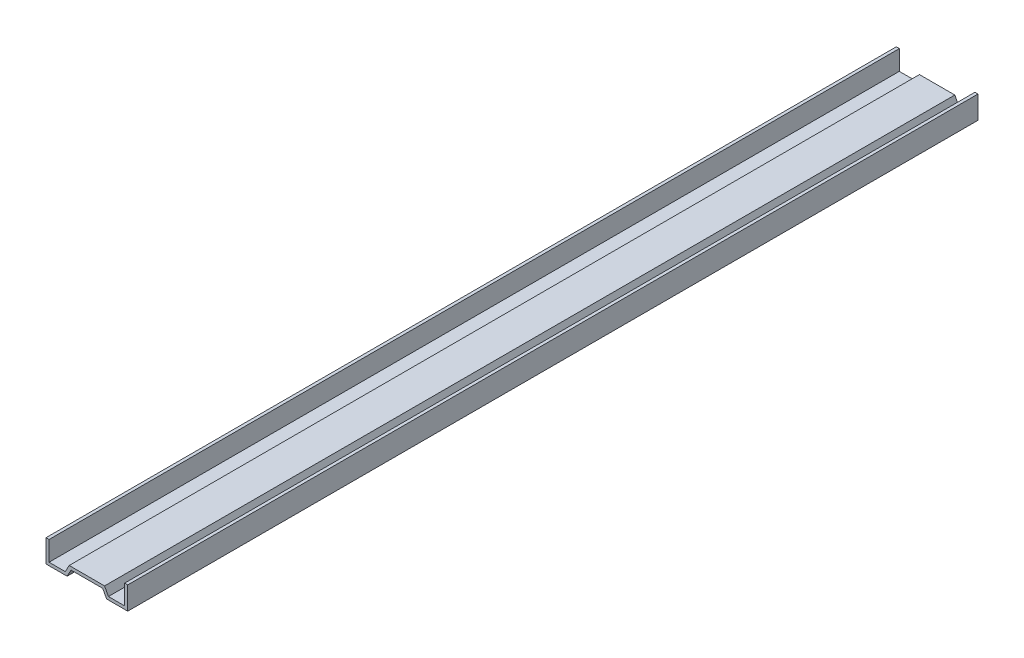
ISO-10303-21;
HEADER;
FILE_DESCRIPTION(('STEP AP214'),'2;1');
FILE_NAME('part.step','',(''),(''),'','','');
FILE_SCHEMA(('AUTOMOTIVE_DESIGN { 1 0 10303 214 1 1 1 1 }'));
ENDSEC;
DATA;
#1=APPLICATION_CONTEXT('core data for automotive mechanical design processes');
#2=APPLICATION_PROTOCOL_DEFINITION('international standard','automotive_design',2000,#1);
#3=PRODUCT_CONTEXT('',#1,'mechanical');
#4=PRODUCT('Part','Part','',(#3));
#5=PRODUCT_RELATED_PRODUCT_CATEGORY('part','',(#4));
#6=PRODUCT_DEFINITION_FORMATION('','',#4);
#7=PRODUCT_DEFINITION_CONTEXT('part definition',#1,'design');
#8=PRODUCT_DEFINITION('design','',#6,#7);
#9=PRODUCT_DEFINITION_SHAPE('','',#8);
#10=(LENGTH_UNIT() NAMED_UNIT(*) SI_UNIT(.MILLI.,.METRE.));
#11=(NAMED_UNIT(*) PLANE_ANGLE_UNIT() SI_UNIT($,.RADIAN.));
#12=(NAMED_UNIT(*) SI_UNIT($,.STERADIAN.) SOLID_ANGLE_UNIT());
#13=UNCERTAINTY_MEASURE_WITH_UNIT(LENGTH_MEASURE(1.E-05),#10,'distance_accuracy_value','');
#14=(GEOMETRIC_REPRESENTATION_CONTEXT(3) GLOBAL_UNCERTAINTY_ASSIGNED_CONTEXT((#13)) GLOBAL_UNIT_ASSIGNED_CONTEXT((#10,
#11,#12)) REPRESENTATION_CONTEXT('',''));
#15=CARTESIAN_POINT('',(0.,0.,0.));
#16=DIRECTION('',(0.,0.,1.));
#17=DIRECTION('',(1.,0.,0.));
#18=AXIS2_PLACEMENT_3D('',#15,#16,#17);
#19=CARTESIAN_POINT('',(16.1,5.30454486616186,0.));
#20=DIRECTION('',(0.,1.,0.));
#21=DIRECTION('',(0.,0.,1.));
#22=AXIS2_PLACEMENT_3D('',#19,#20,#21);
#23=PLANE('',#22);
#24=DIRECTION('',(1.,0.,0.));
#25=VECTOR('',#24,1.);
#26=CARTESIAN_POINT('',(16.1,5.30454486616186,0.));
#27=LINE('',#26,#25);
#28=CARTESIAN_POINT('',(17.4,5.30454486616186,0.));
#29=VERTEX_POINT('',#28);
#30=CARTESIAN_POINT('',(16.1,5.30454486616186,0.));
#31=VERTEX_POINT('',#30);
#32=EDGE_CURVE('E140',#29,#31,#27,.F.);
#33=ORIENTED_EDGE('',*,*,#32,.T.);
#34=DIRECTION('',(0.,0.,1.));
#35=VECTOR('',#34,1.);
#36=CARTESIAN_POINT('',(16.1,5.30454486616186,0.));
#37=LINE('',#36,#35);
#38=CARTESIAN_POINT('',(16.1,5.30454486616186,362.));
#39=VERTEX_POINT('',#38);
#40=EDGE_CURVE('E166',#39,#31,#37,.F.);
#41=ORIENTED_EDGE('',*,*,#40,.F.);
#42=DIRECTION('',(1.,0.,0.));
#43=VECTOR('',#42,1.);
#44=CARTESIAN_POINT('',(16.1,5.30454486616186,362.));
#45=LINE('',#44,#43);
#46=CARTESIAN_POINT('',(17.4,5.30454486616186,362.));
#47=VERTEX_POINT('',#46);
#48=EDGE_CURVE('E19',#39,#47,#45,.T.);
#49=ORIENTED_EDGE('',*,*,#48,.T.);
#50=DIRECTION('',(0.,0.,-1.));
#51=VECTOR('',#50,1.);
#52=CARTESIAN_POINT('',(17.4,5.30454486616186,0.));
#53=LINE('',#52,#51);
#54=EDGE_CURVE('E169',#29,#47,#53,.F.);
#55=ORIENTED_EDGE('',*,*,#54,.F.);
#56=EDGE_LOOP('',(#33,#41,#49,#55));
#57=FACE_BOUND('',#56,.T.);
#58=ADVANCED_FACE('F16',(#57),#23,.T.);
#59=CARTESIAN_POINT('',(-17.4,5.30454486616185,0.));
#60=DIRECTION('',(0.,1.,0.));
#61=DIRECTION('',(0.,0.,1.));
#62=AXIS2_PLACEMENT_3D('',#59,#60,#61);
#63=PLANE('',#62);
#64=DIRECTION('',(1.,0.,0.));
#65=VECTOR('',#64,1.);
#66=CARTESIAN_POINT('',(-17.4,5.30454486616185,0.));
#67=LINE('',#66,#65);
#68=CARTESIAN_POINT('',(-16.1,5.30454486616186,0.));
#69=VERTEX_POINT('',#68);
#70=CARTESIAN_POINT('',(-17.4,5.30454486616186,0.));
#71=VERTEX_POINT('',#70);
#72=EDGE_CURVE('E139',#69,#71,#67,.F.);
#73=ORIENTED_EDGE('',*,*,#72,.T.);
#74=DIRECTION('',(0.,0.,1.));
#75=VECTOR('',#74,1.);
#76=CARTESIAN_POINT('',(-17.4,5.30454486616185,0.));
#77=LINE('',#76,#75);
#78=CARTESIAN_POINT('',(-17.4,5.30454486616186,362.));
#79=VERTEX_POINT('',#78);
#80=EDGE_CURVE('E143',#79,#71,#77,.F.);
#81=ORIENTED_EDGE('',*,*,#80,.F.);
#82=DIRECTION('',(1.,0.,0.));
#83=VECTOR('',#82,1.);
#84=CARTESIAN_POINT('',(-17.4,5.30454486616185,362.));
#85=LINE('',#84,#83);
#86=CARTESIAN_POINT('',(-16.1,5.30454486616186,362.));
#87=VERTEX_POINT('',#86);
#88=EDGE_CURVE('E127',#79,#87,#85,.T.);
#89=ORIENTED_EDGE('',*,*,#88,.T.);
#90=DIRECTION('',(0.,0.,-1.));
#91=VECTOR('',#90,1.);
#92=CARTESIAN_POINT('',(-16.1,5.30454486616185,0.));
#93=LINE('',#92,#91);
#94=EDGE_CURVE('E149',#69,#87,#93,.F.);
#95=ORIENTED_EDGE('',*,*,#94,.F.);
#96=EDGE_LOOP('',(#73,#81,#89,#95));
#97=FACE_BOUND('',#96,.T.);
#98=ADVANCED_FACE('F144',(#97),#63,.T.);
#99=CARTESIAN_POINT('',(-8.4,-4.39545513383814,0.));
#100=DIRECTION('',(0.,-1.,0.));
#101=DIRECTION('',(0.,0.,-1.));
#102=AXIS2_PLACEMENT_3D('',#99,#100,#101);
#103=PLANE('',#102);
#104=DIRECTION('',(1.,0.,0.));
#105=VECTOR('',#104,1.);
#106=CARTESIAN_POINT('',(1.6834460146E-05,-4.39545513383814,0.));
#107=LINE('',#106,#105);
#108=CARTESIAN_POINT('',(-17.4,-4.39545513383814,0.));
#109=VERTEX_POINT('',#108);
#110=CARTESIAN_POINT('',(-8.4,-4.39545513383814,0.));
#111=VERTEX_POINT('',#110);
#112=EDGE_CURVE('E247',#109,#111,#107,.T.);
#113=ORIENTED_EDGE('',*,*,#112,.T.);
#114=DIRECTION('',(0.,0.,1.));
#115=VECTOR('',#114,1.);
#116=CARTESIAN_POINT('',(-8.4,-4.39545513383814,0.));
#117=LINE('',#116,#115);
#118=CARTESIAN_POINT('',(-8.4,-4.39545513383814,362.));
#119=VERTEX_POINT('',#118);
#120=EDGE_CURVE('E184',#119,#111,#117,.F.);
#121=ORIENTED_EDGE('',*,*,#120,.F.);
#122=DIRECTION('',(1.,0.,0.));
#123=VECTOR('',#122,1.);
#124=CARTESIAN_POINT('',(1.6834460146E-05,-4.39545513383814,362.));
#125=LINE('',#124,#123);
#126=CARTESIAN_POINT('',(-17.4,-4.39545513383814,362.));
#127=VERTEX_POINT('',#126);
#128=EDGE_CURVE('E153',#127,#119,#125,.T.);
#129=ORIENTED_EDGE('',*,*,#128,.F.);
#130=DIRECTION('',(0.,0.,1.));
#131=VECTOR('',#130,1.);
#132=CARTESIAN_POINT('',(-17.4,-4.39545513383814,0.));
#133=LINE('',#132,#131);
#134=EDGE_CURVE('E148',#109,#127,#133,.T.);
#135=ORIENTED_EDGE('',*,*,#134,.F.);
#136=EDGE_LOOP('',(#113,#121,#129,#135));
#137=FACE_BOUND('',#136,.T.);
#138=ADVANCED_FACE('F426',(#137),#103,.T.);
#139=CARTESIAN_POINT('',(-6.74988703330764,-1.3,0.));
#140=DIRECTION('',(0.88244719913486,-0.470411458979307,0.));
#141=DIRECTION('',(0.470411458979307,0.88244719913486,0.));
#142=AXIS2_PLACEMENT_3D('',#139,#140,#141);
#143=PLANE('',#142);
#144=DIRECTION('',(0.470411458979307,0.88244719913486,0.));
#145=VECTOR('',#144,1.);
#146=CARTESIAN_POINT('',(-8.4,-4.39545513383814,0.));
#147=LINE('',#146,#145);
#148=CARTESIAN_POINT('',(-6.74988703330764,-1.3,0.));
#149=VERTEX_POINT('',#148);
#150=EDGE_CURVE('E221',#111,#149,#147,.T.);
#151=ORIENTED_EDGE('',*,*,#150,.T.);
#152=DIRECTION('',(0.,0.,-1.));
#153=VECTOR('',#152,1.);
#154=CARTESIAN_POINT('',(-6.74988703330764,-1.3,0.));
#155=LINE('',#154,#153);
#156=CARTESIAN_POINT('',(-6.74988703330764,-1.3,362.));
#157=VERTEX_POINT('',#156);
#158=EDGE_CURVE('E181',#157,#149,#155,.T.);
#159=ORIENTED_EDGE('',*,*,#158,.F.);
#160=DIRECTION('',(0.470411458979307,0.88244719913486,0.));
#161=VECTOR('',#160,1.);
#162=CARTESIAN_POINT('',(-8.4,-4.39545513383814,362.));
#163=LINE('',#162,#161);
#164=EDGE_CURVE('E156',#119,#157,#163,.T.);
#165=ORIENTED_EDGE('',*,*,#164,.F.);
#166=ORIENTED_EDGE('',*,*,#120,.T.);
#167=EDGE_LOOP('',(#151,#159,#165,#166));
#168=FACE_BOUND('',#167,.T.);
#169=ADVANCED_FACE('F219',(#168),#143,.T.);
#170=CARTESIAN_POINT('',(6.75011296669236,-1.3,0.));
#171=DIRECTION('',(0.,-1.,0.));
#172=DIRECTION('',(0.,0.,-1.));
#173=AXIS2_PLACEMENT_3D('',#170,#171,#172);
#174=PLANE('',#173);
#175=DIRECTION('',(1.,0.,0.));
#176=VECTOR('',#175,1.);
#177=CARTESIAN_POINT('',(1.6834460146E-05,-1.3,0.));
#178=LINE('',#177,#176);
#179=CARTESIAN_POINT('',(6.75011296669236,-1.3,0.));
#180=VERTEX_POINT('',#179);
#181=EDGE_CURVE('E226',#149,#180,#178,.T.);
#182=ORIENTED_EDGE('',*,*,#181,.T.);
#183=DIRECTION('',(0.,0.,1.));
#184=VECTOR('',#183,1.);
#185=CARTESIAN_POINT('',(6.75011296669236,-1.3,0.));
#186=LINE('',#185,#184);
#187=CARTESIAN_POINT('',(6.75011296669236,-1.3,362.));
#188=VERTEX_POINT('',#187);
#189=EDGE_CURVE('E178',#188,#180,#186,.F.);
#190=ORIENTED_EDGE('',*,*,#189,.F.);
#191=DIRECTION('',(1.,0.,0.));
#192=VECTOR('',#191,1.);
#193=CARTESIAN_POINT('',(1.6834460146E-05,-1.3,362.));
#194=LINE('',#193,#192);
#195=EDGE_CURVE('E213',#157,#188,#194,.T.);
#196=ORIENTED_EDGE('',*,*,#195,.F.);
#197=ORIENTED_EDGE('',*,*,#158,.T.);
#198=EDGE_LOOP('',(#182,#190,#196,#197));
#199=FACE_BOUND('',#198,.T.);
#200=ADVANCED_FACE('F224',(#199),#174,.T.);
#201=CARTESIAN_POINT('',(8.4,-4.39545513383814,0.));
#202=DIRECTION('',(-0.8824739354314,-0.470361300793568,0.));
#203=DIRECTION('',(0.470361300793568,-0.8824739354314,0.));
#204=AXIS2_PLACEMENT_3D('',#201,#202,#203);
#205=PLANE('',#204);
#206=DIRECTION('',(0.470361300793568,-0.8824739354314,0.));
#207=VECTOR('',#206,1.);
#208=CARTESIAN_POINT('',(6.75011296669236,-1.3,0.));
#209=LINE('',#208,#207);
#210=CARTESIAN_POINT('',(8.4,-4.39545513383814,0.));
#211=VERTEX_POINT('',#210);
#212=EDGE_CURVE('E230',#180,#211,#209,.T.);
#213=ORIENTED_EDGE('',*,*,#212,.T.);
#214=DIRECTION('',(0.,0.,-1.));
#215=VECTOR('',#214,1.);
#216=CARTESIAN_POINT('',(8.4,-4.39545513383814,0.));
#217=LINE('',#216,#215);
#218=CARTESIAN_POINT('',(8.4,-4.39545513383814,362.));
#219=VERTEX_POINT('',#218);
#220=EDGE_CURVE('E175',#219,#211,#217,.T.);
#221=ORIENTED_EDGE('',*,*,#220,.F.);
#222=DIRECTION('',(0.470361300793568,-0.8824739354314,0.));
#223=VECTOR('',#222,1.);
#224=CARTESIAN_POINT('',(6.75011296669236,-1.3,362.));
#225=LINE('',#224,#223);
#226=EDGE_CURVE('E208',#188,#219,#225,.T.);
#227=ORIENTED_EDGE('',*,*,#226,.F.);
#228=ORIENTED_EDGE('',*,*,#189,.T.);
#229=EDGE_LOOP('',(#213,#221,#227,#228));
#230=FACE_BOUND('',#229,.T.);
#231=ADVANCED_FACE('F229',(#230),#205,.T.);
#232=CARTESIAN_POINT('',(17.4,-4.39545513383814,0.));
#233=DIRECTION('',(0.,-1.,0.));
#234=DIRECTION('',(0.,0.,-1.));
#235=AXIS2_PLACEMENT_3D('',#232,#233,#234);
#236=PLANE('',#235);
#237=DIRECTION('',(1.,0.,0.));
#238=VECTOR('',#237,1.);
#239=CARTESIAN_POINT('',(1.6834460146E-05,-4.39545513383814,0.));
#240=LINE('',#239,#238);
#241=CARTESIAN_POINT('',(17.4,-4.39545513383814,0.));
#242=VERTEX_POINT('',#241);
#243=EDGE_CURVE('E234',#211,#242,#240,.T.);
#244=ORIENTED_EDGE('',*,*,#243,.T.);
#245=DIRECTION('',(0.,0.,-1.));
#246=VECTOR('',#245,1.);
#247=CARTESIAN_POINT('',(17.4,-4.39545513383814,0.));
#248=LINE('',#247,#246);
#249=CARTESIAN_POINT('',(17.4,-4.39545513383814,362.));
#250=VERTEX_POINT('',#249);
#251=EDGE_CURVE('E172',#250,#242,#248,.T.);
#252=ORIENTED_EDGE('',*,*,#251,.F.);
#253=DIRECTION('',(1.,0.,0.));
#254=VECTOR('',#253,1.);
#255=CARTESIAN_POINT('',(1.6834460146E-05,-4.39545513383814,362.));
#256=LINE('',#255,#254);
#257=EDGE_CURVE('E203',#219,#250,#256,.T.);
#258=ORIENTED_EDGE('',*,*,#257,.F.);
#259=ORIENTED_EDGE('',*,*,#220,.T.);
#260=EDGE_LOOP('',(#244,#252,#258,#259));
#261=FACE_BOUND('',#260,.T.);
#262=ADVANCED_FACE('F233',(#261),#236,.T.);
#263=CARTESIAN_POINT('',(17.4,5.30454486616186,0.));
#264=DIRECTION('',(1.,0.,0.));
#265=DIRECTION('',(0.,0.,-1.));
#266=AXIS2_PLACEMENT_3D('',#263,#264,#265);
#267=PLANE('',#266);
#268=DIRECTION('',(0.,1.,0.));
#269=VECTOR('',#268,1.);
#270=CARTESIAN_POINT('',(17.4,-1.14082873733996,0.));
#271=LINE('',#270,#269);
#272=EDGE_CURVE('E200',#242,#29,#271,.T.);
#273=ORIENTED_EDGE('',*,*,#272,.T.);
#274=ORIENTED_EDGE('',*,*,#54,.T.);
#275=DIRECTION('',(0.,1.,0.));
#276=VECTOR('',#275,1.);
#277=CARTESIAN_POINT('',(17.4,-1.14082873733996,362.));
#278=LINE('',#277,#276);
#279=EDGE_CURVE('E197',#250,#47,#278,.T.);
#280=ORIENTED_EDGE('',*,*,#279,.F.);
#281=ORIENTED_EDGE('',*,*,#251,.T.);
#282=EDGE_LOOP('',(#273,#274,#280,#281));
#283=FACE_BOUND('',#282,.T.);
#284=ADVANCED_FACE('F196',(#283),#267,.T.);
#285=CARTESIAN_POINT('',(16.1,-3.09545513383814,0.));
#286=DIRECTION('',(-1.,0.,0.));
#287=DIRECTION('',(0.,0.,1.));
#288=AXIS2_PLACEMENT_3D('',#285,#286,#287);
#289=PLANE('',#288);
#290=DIRECTION('',(0.,1.,0.));
#291=VECTOR('',#290,1.);
#292=CARTESIAN_POINT('',(16.1,-1.14082873733996,0.));
#293=LINE('',#292,#291);
#294=CARTESIAN_POINT('',(16.1,-3.09545513383814,0.));
#295=VERTEX_POINT('',#294);
#296=EDGE_CURVE('E237',#31,#295,#293,.F.);
#297=ORIENTED_EDGE('',*,*,#296,.T.);
#298=DIRECTION('',(0.,0.,1.));
#299=VECTOR('',#298,1.);
#300=CARTESIAN_POINT('',(16.1,-3.09545513383814,0.));
#301=LINE('',#300,#299);
#302=CARTESIAN_POINT('',(16.1,-3.09545513383814,362.));
#303=VERTEX_POINT('',#302);
#304=EDGE_CURVE('E163',#303,#295,#301,.F.);
#305=ORIENTED_EDGE('',*,*,#304,.F.);
#306=DIRECTION('',(0.,1.,0.));
#307=VECTOR('',#306,1.);
#308=CARTESIAN_POINT('',(16.1,-1.14082873733996,362.));
#309=LINE('',#308,#307);
#310=EDGE_CURVE('E204',#39,#303,#309,.F.);
#311=ORIENTED_EDGE('',*,*,#310,.F.);
#312=ORIENTED_EDGE('',*,*,#40,.T.);
#313=EDGE_LOOP('',(#297,#305,#311,#312));
#314=FACE_BOUND('',#313,.T.);
#315=ADVANCED_FACE('F303',(#314),#289,.T.);
#316=CARTESIAN_POINT('',(9.18022736006562,-3.09545513383814,0.));
#317=DIRECTION('',(0.,1.,0.));
#318=DIRECTION('',(0.,0.,1.));
#319=AXIS2_PLACEMENT_3D('',#316,#317,#318);
#320=PLANE('',#319);
#321=DIRECTION('',(1.,0.,0.));
#322=VECTOR('',#321,1.);
#323=CARTESIAN_POINT('',(1.6834460146E-05,-3.09545513383814,0.));
#324=LINE('',#323,#322);
#325=CARTESIAN_POINT('',(9.18022736006562,-3.09545513383814,0.));
#326=VERTEX_POINT('',#325);
#327=EDGE_CURVE('E239',#295,#326,#324,.F.);
#328=ORIENTED_EDGE('',*,*,#327,.T.);
#329=DIRECTION('',(0.,0.,1.));
#330=VECTOR('',#329,1.);
#331=CARTESIAN_POINT('',(9.18022736006562,-3.09545513383814,0.));
#332=LINE('',#331,#330);
#333=CARTESIAN_POINT('',(9.18022736006562,-3.09545513383814,362.));
#334=VERTEX_POINT('',#333);
#335=EDGE_CURVE('E249',#334,#326,#332,.F.);
#336=ORIENTED_EDGE('',*,*,#335,.F.);
#337=DIRECTION('',(1.,0.,0.));
#338=VECTOR('',#337,1.);
#339=CARTESIAN_POINT('',(1.6834460146E-05,-3.09545513383814,362.));
#340=LINE('',#339,#338);
#341=EDGE_CURVE('E206',#303,#334,#340,.F.);
#342=ORIENTED_EDGE('',*,*,#341,.F.);
#343=ORIENTED_EDGE('',*,*,#304,.T.);
#344=EDGE_LOOP('',(#328,#336,#342,#343));
#345=FACE_BOUND('',#344,.T.);
#346=ADVANCED_FACE('F261',(#345),#320,.T.);
#347=CARTESIAN_POINT('',(-16.1,5.30454486616185,0.));
#348=DIRECTION('',(1.,0.,0.));
#349=DIRECTION('',(0.,0.,-1.));
#350=AXIS2_PLACEMENT_3D('',#347,#348,#349);
#351=PLANE('',#350);
#352=DIRECTION('',(0.,1.,0.));
#353=VECTOR('',#352,1.);
#354=CARTESIAN_POINT('',(-16.1,-1.14082873733996,0.));
#355=LINE('',#354,#353);
#356=CARTESIAN_POINT('',(-16.1,-3.09545513383814,0.));
#357=VERTEX_POINT('',#356);
#358=EDGE_CURVE('E288',#357,#69,#355,.T.);
#359=ORIENTED_EDGE('',*,*,#358,.T.);
#360=ORIENTED_EDGE('',*,*,#94,.T.);
#361=DIRECTION('',(0.,1.,0.));
#362=VECTOR('',#361,1.);
#363=CARTESIAN_POINT('',(-16.1,-1.14082873733996,362.));
#364=LINE('',#363,#362);
#365=CARTESIAN_POINT('',(-16.1,-3.09545513383814,362.));
#366=VERTEX_POINT('',#365);
#367=EDGE_CURVE('E138',#366,#87,#364,.T.);
#368=ORIENTED_EDGE('',*,*,#367,.F.);
#369=DIRECTION('',(0.,0.,1.));
#370=VECTOR('',#369,1.);
#371=CARTESIAN_POINT('',(-16.1,-3.09545513383814,0.));
#372=LINE('',#371,#370);
#373=EDGE_CURVE('E154',#357,#366,#372,.T.);
#374=ORIENTED_EDGE('',*,*,#373,.F.);
#375=EDGE_LOOP('',(#359,#360,#368,#374));
#376=FACE_BOUND('',#375,.T.);
#377=ADVANCED_FACE('F299',(#376),#351,.T.);
#378=CARTESIAN_POINT('',(-17.4,-4.39545513383814,0.));
#379=DIRECTION('',(-1.,0.,0.));
#380=DIRECTION('',(0.,0.,1.));
#381=AXIS2_PLACEMENT_3D('',#378,#379,#380);
#382=PLANE('',#381);
#383=DIRECTION('',(0.,1.,0.));
#384=VECTOR('',#383,1.);
#385=CARTESIAN_POINT('',(-17.4,-1.14082873733996,0.));
#386=LINE('',#385,#384);
#387=EDGE_CURVE('E286',#71,#109,#386,.F.);
#388=ORIENTED_EDGE('',*,*,#387,.T.);
#389=ORIENTED_EDGE('',*,*,#134,.T.);
#390=DIRECTION('',(0.,1.,0.));
#391=VECTOR('',#390,1.);
#392=CARTESIAN_POINT('',(-17.4,-1.14082873733996,362.));
#393=LINE('',#392,#391);
#394=EDGE_CURVE('E136',#79,#127,#393,.F.);
#395=ORIENTED_EDGE('',*,*,#394,.F.);
#396=ORIENTED_EDGE('',*,*,#80,.T.);
#397=EDGE_LOOP('',(#388,#389,#395,#396));
#398=FACE_BOUND('',#397,.T.);
#399=ADVANCED_FACE('F151',(#398),#382,.T.);
#400=CARTESIAN_POINT('',(-16.1,-3.09545513383814,0.));
#401=DIRECTION('',(0.,1.,0.));
#402=DIRECTION('',(0.,0.,1.));
#403=AXIS2_PLACEMENT_3D('',#400,#401,#402);
#404=PLANE('',#403);
#405=DIRECTION('',(1.,0.,0.));
#406=VECTOR('',#405,1.);
#407=CARTESIAN_POINT('',(1.6834460146E-05,-3.09545513383814,0.));
#408=LINE('',#407,#406);
#409=CARTESIAN_POINT('',(-9.18045329345033,-3.09545513383814,0.));
#410=VERTEX_POINT('',#409);
#411=EDGE_CURVE('E291',#410,#357,#408,.F.);
#412=ORIENTED_EDGE('',*,*,#411,.T.);
#413=ORIENTED_EDGE('',*,*,#373,.T.);
#414=DIRECTION('',(1.,0.,0.));
#415=VECTOR('',#414,1.);
#416=CARTESIAN_POINT('',(1.6834460146E-05,-3.09545513383814,362.));
#417=LINE('',#416,#415);
#418=CARTESIAN_POINT('',(-9.18045329345033,-3.09545513383814,362.));
#419=VERTEX_POINT('',#418);
#420=EDGE_CURVE('E256',#419,#366,#417,.F.);
#421=ORIENTED_EDGE('',*,*,#420,.F.);
#422=DIRECTION('',(0.,0.,1.));
#423=VECTOR('',#422,1.);
#424=CARTESIAN_POINT('',(-9.18045329345033,-3.09545513383814,0.));
#425=LINE('',#424,#423);
#426=EDGE_CURVE('E277',#410,#419,#425,.T.);
#427=ORIENTED_EDGE('',*,*,#426,.F.);
#428=EDGE_LOOP('',(#412,#413,#421,#427));
#429=FACE_BOUND('',#428,.T.);
#430=ADVANCED_FACE('F297',(#429),#404,.T.);
#431=CARTESIAN_POINT('',(1.6834460146E-05,-1.14082873733996,362.));
#432=DIRECTION('',(0.,0.,1.));
#433=DIRECTION('',(1.,0.,0.));
#434=AXIS2_PLACEMENT_3D('',#431,#432,#433);
#435=PLANE('',#434);
#436=ORIENTED_EDGE('',*,*,#420,.T.);
#437=ORIENTED_EDGE('',*,*,#367,.T.);
#438=ORIENTED_EDGE('',*,*,#88,.F.);
#439=ORIENTED_EDGE('',*,*,#394,.T.);
#440=ORIENTED_EDGE('',*,*,#128,.T.);
#441=ORIENTED_EDGE('',*,*,#164,.T.);
#442=ORIENTED_EDGE('',*,*,#195,.T.);
#443=ORIENTED_EDGE('',*,*,#226,.T.);
#444=ORIENTED_EDGE('',*,*,#257,.T.);
#445=ORIENTED_EDGE('',*,*,#279,.T.);
#446=ORIENTED_EDGE('',*,*,#48,.F.);
#447=ORIENTED_EDGE('',*,*,#310,.T.);
#448=ORIENTED_EDGE('',*,*,#341,.T.);
#449=DIRECTION('',(-0.470361300793567,0.8824739354314,0.));
#450=VECTOR('',#449,1.);
#451=CARTESIAN_POINT('',(7.53034032675798,0.,362.));
#452=LINE('',#451,#450);
#453=CARTESIAN_POINT('',(7.53034032675798,0.,362.));
#454=VERTEX_POINT('',#453);
#455=EDGE_CURVE('E252',#454,#334,#452,.F.);
#456=ORIENTED_EDGE('',*,*,#455,.F.);
#457=DIRECTION('',(1.,0.,0.));
#458=VECTOR('',#457,1.);
#459=CARTESIAN_POINT('',(-7.53034032675798,0.,362.));
#460=LINE('',#459,#458);
#461=CARTESIAN_POINT('',(-7.53034032675798,0.,362.));
#462=VERTEX_POINT('',#461);
#463=EDGE_CURVE('E272',#462,#454,#460,.T.);
#464=ORIENTED_EDGE('',*,*,#463,.F.);
#465=DIRECTION('',(-0.470411458979307,-0.88244719913486,0.));
#466=VECTOR('',#465,1.);
#467=CARTESIAN_POINT('',(-9.18045329345033,-3.09545513383814,362.));
#468=LINE('',#467,#466);
#469=EDGE_CURVE('E284',#419,#462,#468,.F.);
#470=ORIENTED_EDGE('',*,*,#469,.F.);
#471=EDGE_LOOP('',(#436,#437,#438,#439,#440,#441,#442,#443,#444,#445,#446,#447,#448,#456,#464,#470));
#472=FACE_BOUND('',#471,.T.);
#473=ADVANCED_FACE('F133',(#472),#435,.T.);
#474=CARTESIAN_POINT('',(7.53034032675798,0.,0.));
#475=DIRECTION('',(0.8824739354314,0.470361300793567,0.));
#476=DIRECTION('',(-0.470361300793567,0.8824739354314,0.));
#477=AXIS2_PLACEMENT_3D('',#474,#475,#476);
#478=PLANE('',#477);
#479=DIRECTION('',(-0.470361300793568,0.8824739354314,0.));
#480=VECTOR('',#479,1.);
#481=CARTESIAN_POINT('',(9.18022736006562,-3.09545513383814,0.));
#482=LINE('',#481,#480);
#483=CARTESIAN_POINT('',(7.53034032675798,0.,0.));
#484=VERTEX_POINT('',#483);
#485=EDGE_CURVE('E269',#326,#484,#482,.T.);
#486=ORIENTED_EDGE('',*,*,#485,.T.);
#487=DIRECTION('',(0.,0.,1.));
#488=VECTOR('',#487,1.);
#489=CARTESIAN_POINT('',(7.53034032675798,0.,0.));
#490=LINE('',#489,#488);
#491=EDGE_CURVE('E267',#454,#484,#490,.F.);
#492=ORIENTED_EDGE('',*,*,#491,.F.);
#493=ORIENTED_EDGE('',*,*,#455,.T.);
#494=ORIENTED_EDGE('',*,*,#335,.T.);
#495=EDGE_LOOP('',(#486,#492,#493,#494));
#496=FACE_BOUND('',#495,.T.);
#497=ADVANCED_FACE('F265',(#496),#478,.T.);
#498=CARTESIAN_POINT('',(1.6834460146E-05,-1.14082873733996,0.));
#499=DIRECTION('',(0.,0.,1.));
#500=DIRECTION('',(1.,0.,0.));
#501=AXIS2_PLACEMENT_3D('',#498,#499,#500);
#502=PLANE('',#501);
#503=ORIENTED_EDGE('',*,*,#72,.F.);
#504=ORIENTED_EDGE('',*,*,#358,.F.);
#505=ORIENTED_EDGE('',*,*,#411,.F.);
#506=DIRECTION('',(-0.470411458979307,-0.88244719913486,0.));
#507=VECTOR('',#506,1.);
#508=CARTESIAN_POINT('',(-9.18045329345033,-3.09545513383814,0.));
#509=LINE('',#508,#507);
#510=CARTESIAN_POINT('',(-7.53034032675798,0.,0.));
#511=VERTEX_POINT('',#510);
#512=EDGE_CURVE('E34',#511,#410,#509,.T.);
#513=ORIENTED_EDGE('',*,*,#512,.F.);
#514=DIRECTION('',(1.,0.,0.));
#515=VECTOR('',#514,1.);
#516=CARTESIAN_POINT('',(-7.53034032675798,0.,0.));
#517=LINE('',#516,#515);
#518=EDGE_CURVE('E25',#484,#511,#517,.F.);
#519=ORIENTED_EDGE('',*,*,#518,.F.);
#520=ORIENTED_EDGE('',*,*,#485,.F.);
#521=ORIENTED_EDGE('',*,*,#327,.F.);
#522=ORIENTED_EDGE('',*,*,#296,.F.);
#523=ORIENTED_EDGE('',*,*,#32,.F.);
#524=ORIENTED_EDGE('',*,*,#272,.F.);
#525=ORIENTED_EDGE('',*,*,#243,.F.);
#526=ORIENTED_EDGE('',*,*,#212,.F.);
#527=ORIENTED_EDGE('',*,*,#181,.F.);
#528=ORIENTED_EDGE('',*,*,#150,.F.);
#529=ORIENTED_EDGE('',*,*,#112,.F.);
#530=ORIENTED_EDGE('',*,*,#387,.F.);
#531=EDGE_LOOP('',(#503,#504,#505,#513,#519,#520,#521,#522,#523,#524,#525,#526,#527,#528,#529,#530));
#532=FACE_BOUND('',#531,.T.);
#533=ADVANCED_FACE('F235',(#532),#502,.F.);
#534=CARTESIAN_POINT('',(-9.18045329345033,-3.09545513383814,0.));
#535=DIRECTION('',(-0.88244719913486,0.470411458979307,0.));
#536=DIRECTION('',(-0.470411458979307,-0.88244719913486,0.));
#537=AXIS2_PLACEMENT_3D('',#534,#535,#536);
#538=PLANE('',#537);
#539=ORIENTED_EDGE('',*,*,#512,.T.);
#540=ORIENTED_EDGE('',*,*,#426,.T.);
#541=ORIENTED_EDGE('',*,*,#469,.T.);
#542=DIRECTION('',(0.,0.,1.));
#543=VECTOR('',#542,1.);
#544=CARTESIAN_POINT('',(-7.53034032675798,0.,0.));
#545=LINE('',#544,#543);
#546=EDGE_CURVE('E11',#511,#462,#545,.T.);
#547=ORIENTED_EDGE('',*,*,#546,.F.);
#548=EDGE_LOOP('',(#539,#540,#541,#547));
#549=FACE_BOUND('',#548,.T.);
#550=ADVANCED_FACE('F301',(#549),#538,.T.);
#551=CARTESIAN_POINT('',(-7.53034032675798,0.,0.));
#552=DIRECTION('',(0.,1.,0.));
#553=DIRECTION('',(0.,0.,1.));
#554=AXIS2_PLACEMENT_3D('',#551,#552,#553);
#555=PLANE('',#554);
#556=ORIENTED_EDGE('',*,*,#518,.T.);
#557=ORIENTED_EDGE('',*,*,#546,.T.);
#558=ORIENTED_EDGE('',*,*,#463,.T.);
#559=ORIENTED_EDGE('',*,*,#491,.T.);
#560=EDGE_LOOP('',(#556,#557,#558,#559));
#561=FACE_BOUND('',#560,.T.);
#562=ADVANCED_FACE('F274',(#561),#555,.T.);
#563=CLOSED_SHELL('',(#58,#98,#138,#169,#200,#231,#262,#284,#315,#346,#377,#399,#430,#473,#497,
#533,#550,#562));
#564=MANIFOLD_SOLID_BREP('B1',#563);
#565=ADVANCED_BREP_SHAPE_REPRESENTATION('',(#18,#564),#14);
#566=SHAPE_DEFINITION_REPRESENTATION(#9,#565);
ENDSEC;
END-ISO-10303-21;
